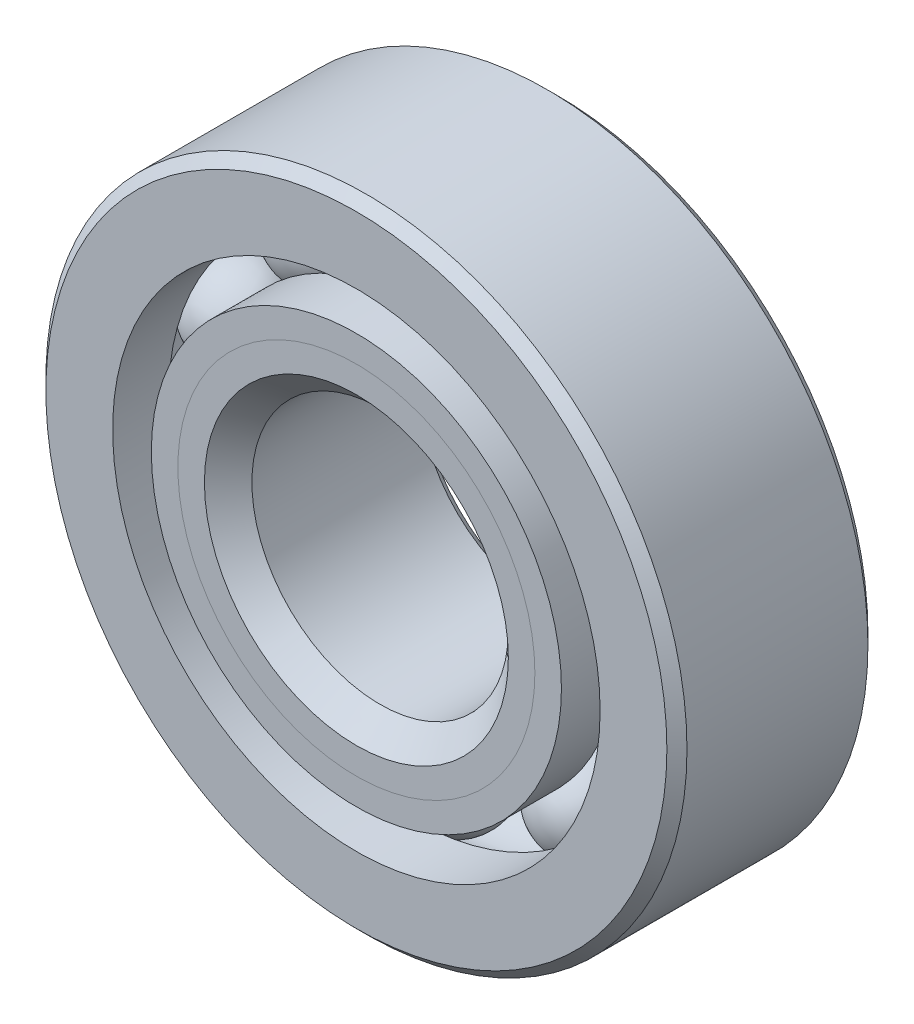
ISO-10303-21;
HEADER;
FILE_DESCRIPTION(('STEP AP214'),'2;1');
FILE_NAME('part.step','',(''),(''),'','','');
FILE_SCHEMA(('AUTOMOTIVE_DESIGN { 1 0 10303 214 1 1 1 1 }'));
ENDSEC;
DATA;
#1=APPLICATION_CONTEXT('core data for automotive mechanical design processes');
#2=APPLICATION_PROTOCOL_DEFINITION('international standard','automotive_design',2000,#1);
#3=PRODUCT_CONTEXT('',#1,'mechanical');
#4=PRODUCT('Part','Part','',(#3));
#5=PRODUCT_RELATED_PRODUCT_CATEGORY('part','',(#4));
#6=PRODUCT_DEFINITION_FORMATION('','',#4);
#7=PRODUCT_DEFINITION_CONTEXT('part definition',#1,'design');
#8=PRODUCT_DEFINITION('design','',#6,#7);
#9=PRODUCT_DEFINITION_SHAPE('','',#8);
#10=(LENGTH_UNIT() NAMED_UNIT(*) SI_UNIT(.MILLI.,.METRE.));
#11=(NAMED_UNIT(*) PLANE_ANGLE_UNIT() SI_UNIT($,.RADIAN.));
#12=(NAMED_UNIT(*) SI_UNIT($,.STERADIAN.) SOLID_ANGLE_UNIT());
#13=UNCERTAINTY_MEASURE_WITH_UNIT(LENGTH_MEASURE(1.E-05),#10,'distance_accuracy_value','');
#14=(GEOMETRIC_REPRESENTATION_CONTEXT(3) GLOBAL_UNCERTAINTY_ASSIGNED_CONTEXT((#13)) GLOBAL_UNIT_ASSIGNED_CONTEXT((#10,
#11,#12)) REPRESENTATION_CONTEXT('',''));
#15=CARTESIAN_POINT('',(0.,0.,0.));
#16=DIRECTION('',(0.,0.,1.));
#17=DIRECTION('',(1.,0.,0.));
#18=AXIS2_PLACEMENT_3D('',#15,#16,#17);
#19=CARTESIAN_POINT('',(-3.26588180805,4.49510067499584,0.));
#20=DIRECTION('',(0.,0.,1.));
#21=DIRECTION('',(-0.587785252292462,0.809016994374955,0.));
#22=AXIS2_PLACEMENT_3D('',#19,#20,#21);
#23=SPHERICAL_SURFACE('',#22,1.20554465033679);
#24=CARTESIAN_POINT('',(-3.26588180805,4.49510067499584,1.20554465033679));
#25=VERTEX_POINT('',#24);
#26=VERTEX_LOOP('',#25);
#27=FACE_BOUND('',#26,.T.);
#28=ADVANCED_FACE('F42',(#27),#23,.T.);
#29=CLOSED_SHELL('',(#28));
#30=MANIFOLD_SOLID_BREP('B2',#29);
#31=CARTESIAN_POINT('',(-5.28430776866493,1.71697567499586,0.));
#32=DIRECTION('',(0.,0.,1.));
#33=DIRECTION('',(-0.95105651629515,0.309016994374958,0.));
#34=AXIS2_PLACEMENT_3D('',#31,#32,#33);
#35=SPHERICAL_SURFACE('',#34,1.20554465033679);
#36=CARTESIAN_POINT('',(-5.28430776866493,1.71697567499586,1.20554465033679));
#37=VERTEX_POINT('',#36);
#38=VERTEX_LOOP('',#37);
#39=FACE_BOUND('',#38,.T.);
#40=ADVANCED_FACE('F76',(#39),#35,.T.);
#41=CLOSED_SHELL('',(#40));
#42=MANIFOLD_SOLID_BREP('B6',#41);
#43=CARTESIAN_POINT('',(-5.28430776866496,-1.71697567499575,0.));
#44=DIRECTION('',(0.,0.,1.));
#45=DIRECTION('',(-0.951056516295157,-0.309016994374938,0.));
#46=AXIS2_PLACEMENT_3D('',#43,#44,#45);
#47=SPHERICAL_SURFACE('',#46,1.20554465033679);
#48=CARTESIAN_POINT('',(-5.28430776866496,-1.71697567499575,1.20554465033679));
#49=VERTEX_POINT('',#48);
#50=VERTEX_LOOP('',#49);
#51=FACE_BOUND('',#50,.T.);
#52=ADVANCED_FACE('F110',(#51),#47,.T.);
#53=CLOSED_SHELL('',(#52));
#54=MANIFOLD_SOLID_BREP('B38',#53);
#55=CARTESIAN_POINT('',(-3.26588180805009,-4.49510067499577,0.));
#56=DIRECTION('',(0.,0.,1.));
#57=DIRECTION('',(-0.58778525229248,-0.809016994374942,0.));
#58=AXIS2_PLACEMENT_3D('',#55,#56,#57);
#59=SPHERICAL_SURFACE('',#58,1.20554465033679);
#60=CARTESIAN_POINT('',(-3.26588180805009,-4.49510067499577,1.20554465033679));
#61=VERTEX_POINT('',#60);
#62=VERTEX_LOOP('',#61);
#63=FACE_BOUND('',#62,.T.);
#64=ADVANCED_FACE('F144',(#63),#59,.T.);
#65=CLOSED_SHELL('',(#64));
#66=MANIFOLD_SOLID_BREP('B72',#65);
#67=CARTESIAN_POINT('',(0.,-5.55625,0.));
#68=DIRECTION('',(0.,0.,1.));
#69=DIRECTION('',(0.,-1.,0.));
#70=AXIS2_PLACEMENT_3D('',#67,#68,#69);
#71=SPHERICAL_SURFACE('',#70,1.20554465033679);
#72=CARTESIAN_POINT('',(0.,-5.55625,1.20554465033679));
#73=VERTEX_POINT('',#72);
#74=VERTEX_LOOP('',#73);
#75=FACE_BOUND('',#74,.T.);
#76=ADVANCED_FACE('F178',(#75),#71,.T.);
#77=CLOSED_SHELL('',(#76));
#78=MANIFOLD_SOLID_BREP('B106',#77);
#79=CARTESIAN_POINT('',(3.26588180805003,-4.49510067499582,0.));
#80=DIRECTION('',(0.,0.,1.));
#81=DIRECTION('',(0.587785252292469,-0.809016994374951,0.));
#82=AXIS2_PLACEMENT_3D('',#79,#80,#81);
#83=SPHERICAL_SURFACE('',#82,1.20554465033679);
#84=CARTESIAN_POINT('',(3.26588180805003,-4.49510067499582,1.20554465033679));
#85=VERTEX_POINT('',#84);
#86=VERTEX_LOOP('',#85);
#87=FACE_BOUND('',#86,.T.);
#88=ADVANCED_FACE('F212',(#87),#83,.T.);
#89=CLOSED_SHELL('',(#88));
#90=MANIFOLD_SOLID_BREP('B140',#89);
#91=CARTESIAN_POINT('',(5.28430776866494,-1.71697567499582,0.));
#92=DIRECTION('',(0.,0.,1.));
#93=DIRECTION('',(0.951056516295152,-0.309016994374952,0.));
#94=AXIS2_PLACEMENT_3D('',#91,#92,#93);
#95=SPHERICAL_SURFACE('',#94,1.20554465033679);
#96=CARTESIAN_POINT('',(5.28430776866494,-1.71697567499582,1.20554465033679));
#97=VERTEX_POINT('',#96);
#98=VERTEX_LOOP('',#97);
#99=FACE_BOUND('',#98,.T.);
#100=ADVANCED_FACE('F246',(#99),#95,.T.);
#101=CLOSED_SHELL('',(#100));
#102=MANIFOLD_SOLID_BREP('B174',#101);
#103=CARTESIAN_POINT('',(5.28430776866495,1.71697567499579,0.));
#104=DIRECTION('',(0.,0.,1.));
#105=DIRECTION('',(0.951056516295155,0.309016994374945,0.));
#106=AXIS2_PLACEMENT_3D('',#103,#104,#105);
#107=SPHERICAL_SURFACE('',#106,1.20554465033679);
#108=CARTESIAN_POINT('',(5.28430776866495,1.71697567499579,1.20554465033679));
#109=VERTEX_POINT('',#108);
#110=VERTEX_LOOP('',#109);
#111=FACE_BOUND('',#110,.T.);
#112=ADVANCED_FACE('F280',(#111),#107,.T.);
#113=CLOSED_SHELL('',(#112));
#114=MANIFOLD_SOLID_BREP('B208',#113);
#115=CARTESIAN_POINT('',(3.26588180805006,4.4951006749958,0.));
#116=DIRECTION('',(0.,0.,1.));
#117=DIRECTION('',(0.587785252292474,0.809016994374947,0.));
#118=AXIS2_PLACEMENT_3D('',#115,#116,#117);
#119=SPHERICAL_SURFACE('',#118,1.20554465033679);
#120=CARTESIAN_POINT('',(3.26588180805006,4.4951006749958,1.20554465033679));
#121=VERTEX_POINT('',#120);
#122=VERTEX_LOOP('',#121);
#123=FACE_BOUND('',#122,.T.);
#124=ADVANCED_FACE('F314',(#123),#119,.T.);
#125=CLOSED_SHELL('',(#124));
#126=MANIFOLD_SOLID_BREP('B242',#125);
#127=CARTESIAN_POINT('',(0.,5.55625,0.));
#128=DIRECTION('',(0.,0.,1.));
#129=DIRECTION('',(0.,1.,0.));
#130=AXIS2_PLACEMENT_3D('',#127,#128,#129);
#131=SPHERICAL_SURFACE('',#130,1.20554465033679);
#132=CARTESIAN_POINT('',(0.,5.55625,1.20554465033679));
#133=VERTEX_POINT('',#132);
#134=VERTEX_LOOP('',#133);
#135=FACE_BOUND('',#134,.T.);
#136=ADVANCED_FACE('F350',(#135),#131,.T.);
#137=CLOSED_SHELL('',(#136));
#138=MANIFOLD_SOLID_BREP('B276',#137);
#139=CARTESIAN_POINT('',(0.,4.42006562313009,2.4892));
#140=DIRECTION('',(0.,0.,-1.));
#141=DIRECTION('',(-1.,0.,0.));
#142=AXIS2_PLACEMENT_3D('',#139,#140,#141);
#143=PLANE('',#142);
#144=CARTESIAN_POINT('',(0.,0.,2.4892));
#145=DIRECTION('',(0.,0.,1.));
#146=DIRECTION('',(1.,0.,0.));
#147=AXIS2_PLACEMENT_3D('',#144,#145,#146);
#148=CIRCLE('',#147,3.76285267483161);
#149=CARTESIAN_POINT('',(3.76285267483161,0.,2.4892));
#150=VERTEX_POINT('',#149);
#151=EDGE_CURVE('E405',#150,#150,#148,.T.);
#152=ORIENTED_EDGE('',*,*,#151,.F.);
#153=EDGE_LOOP('',(#152));
#154=FACE_BOUND('',#153,.T.);
#155=CARTESIAN_POINT('',(0.,0.,2.4892));
#156=DIRECTION('',(0.,0.,1.));
#157=DIRECTION('',(1.,0.,0.));
#158=AXIS2_PLACEMENT_3D('',#155,#156,#157);
#159=CIRCLE('',#158,4.42006562313009);
#160=CARTESIAN_POINT('',(4.42006562313009,0.,2.4892));
#161=VERTEX_POINT('',#160);
#162=EDGE_CURVE('E349',#161,#161,#159,.T.);
#163=ORIENTED_EDGE('',*,*,#162,.T.);
#164=EDGE_LOOP('',(#163));
#165=FACE_BOUND('',#164,.T.);
#166=ADVANCED_FACE('F371',(#154,#165),#143,.F.);
#167=CARTESIAN_POINT('',(0.,0.,1.83198705170152));
#168=DIRECTION('',(0.,0.,1.));
#169=DIRECTION('',(1.,0.,0.));
#170=AXIS2_PLACEMENT_3D('',#167,#168,#169);
#171=CONICAL_SURFACE('',#170,3.7628526748316,0.78539816339745);
#172=ORIENTED_EDGE('',*,*,#162,.F.);
#173=EDGE_LOOP('',(#172));
#174=FACE_BOUND('',#173,.T.);
#175=CARTESIAN_POINT('',(0.,0.,1.83198705170152));
#176=DIRECTION('',(0.,0.,1.));
#177=DIRECTION('',(1.,0.,0.));
#178=AXIS2_PLACEMENT_3D('',#175,#176,#177);
#179=CIRCLE('',#178,3.7628526748316);
#180=CARTESIAN_POINT('',(3.7628526748316,0.,1.83198705170152));
#181=VERTEX_POINT('',#180);
#182=EDGE_CURVE('E377',#181,#181,#179,.T.);
#183=ORIENTED_EDGE('',*,*,#182,.T.);
#184=EDGE_LOOP('',(#183));
#185=FACE_BOUND('',#184,.T.);
#186=ADVANCED_FACE('F412',(#174,#185),#171,.T.);
#187=CARTESIAN_POINT('',(0.,0.,2.4892));
#188=DIRECTION('',(0.,0.,1.));
#189=DIRECTION('',(1.,0.,0.));
#190=AXIS2_PLACEMENT_3D('',#187,#188,#189);
#191=CYLINDRICAL_SURFACE('',#190,3.7628526748316);
#192=ORIENTED_EDGE('',*,*,#182,.F.);
#193=EDGE_LOOP('',(#192));
#194=FACE_BOUND('',#193,.T.);
#195=CARTESIAN_POINT('',(0.,0.,0.));
#196=DIRECTION('',(0.,0.,1.));
#197=DIRECTION('',(1.,0.,0.));
#198=AXIS2_PLACEMENT_3D('',#195,#196,#197);
#199=CIRCLE('',#198,3.7628526748316);
#200=CARTESIAN_POINT('',(3.7628526748316,0.,0.));
#201=VERTEX_POINT('',#200);
#202=EDGE_CURVE('E381',#201,#201,#199,.T.);
#203=ORIENTED_EDGE('',*,*,#202,.T.);
#204=EDGE_LOOP('',(#203));
#205=FACE_BOUND('',#204,.T.);
#206=ADVANCED_FACE('F416',(#194,#205),#191,.T.);
#207=CARTESIAN_POINT('',(0.,3.7628526748316,0.));
#208=DIRECTION('',(0.,0.,-1.));
#209=DIRECTION('',(-1.,0.,0.));
#210=AXIS2_PLACEMENT_3D('',#207,#208,#209);
#211=PLANE('',#210);
#212=ORIENTED_EDGE('',*,*,#202,.F.);
#213=EDGE_LOOP('',(#212));
#214=FACE_BOUND('',#213,.T.);
#215=CARTESIAN_POINT('',(0.,0.,0.));
#216=DIRECTION('',(0.,0.,1.));
#217=DIRECTION('',(1.,0.,0.));
#218=AXIS2_PLACEMENT_3D('',#215,#216,#217);
#219=CIRCLE('',#218,4.35070534966321);
#220=CARTESIAN_POINT('',(4.35070534966321,0.,0.));
#221=VERTEX_POINT('',#220);
#222=EDGE_CURVE('E385',#221,#221,#219,.T.);
#223=ORIENTED_EDGE('',*,*,#222,.T.);
#224=EDGE_LOOP('',(#223));
#225=FACE_BOUND('',#224,.T.);
#226=ADVANCED_FACE('F421',(#214,#225),#211,.F.);
#227=CARTESIAN_POINT('',(0.,0.,0.));
#228=DIRECTION('',(0.,0.,1.));
#229=DIRECTION('',(1.,0.,0.));
#230=AXIS2_PLACEMENT_3D('',#227,#228,#229);
#231=TOROIDAL_SURFACE('',#230,5.55625,1.20554465033679);
#232=ORIENTED_EDGE('',*,*,#222,.F.);
#233=EDGE_LOOP('',(#232));
#234=FACE_BOUND('',#233,.T.);
#235=CARTESIAN_POINT('',(0.,0.,-1.10631111111111));
#236=DIRECTION('',(0.,0.,1.));
#237=DIRECTION('',(1.,0.,0.));
#238=AXIS2_PLACEMENT_3D('',#235,#236,#237);
#239=CIRCLE('',#238,5.07727857142857);
#240=CARTESIAN_POINT('',(5.07727857142857,0.,-1.10631111111111));
#241=VERTEX_POINT('',#240);
#242=EDGE_CURVE('E390',#241,#241,#239,.T.);
#243=ORIENTED_EDGE('',*,*,#242,.T.);
#244=EDGE_LOOP('',(#243));
#245=FACE_BOUND('',#244,.T.);
#246=ADVANCED_FACE('F427',(#234,#245),#231,.F.);
#247=CARTESIAN_POINT('',(0.,0.,2.4892));
#248=DIRECTION('',(0.,0.,1.));
#249=DIRECTION('',(1.,0.,0.));
#250=AXIS2_PLACEMENT_3D('',#247,#248,#249);
#251=CYLINDRICAL_SURFACE('',#250,5.07727857142857);
#252=ORIENTED_EDGE('',*,*,#242,.F.);
#253=EDGE_LOOP('',(#252));
#254=FACE_BOUND('',#253,.T.);
#255=CARTESIAN_POINT('',(0.,0.,-2.4892));
#256=DIRECTION('',(0.,0.,1.));
#257=DIRECTION('',(1.,0.,0.));
#258=AXIS2_PLACEMENT_3D('',#255,#256,#257);
#259=CIRCLE('',#258,5.07727857142857);
#260=CARTESIAN_POINT('',(5.07727857142857,0.,-2.4892));
#261=VERTEX_POINT('',#260);
#262=EDGE_CURVE('E393',#261,#261,#259,.T.);
#263=ORIENTED_EDGE('',*,*,#262,.T.);
#264=EDGE_LOOP('',(#263));
#265=FACE_BOUND('',#264,.T.);
#266=ADVANCED_FACE('F431',(#254,#265),#251,.T.);
#267=CARTESIAN_POINT('',(0.,3.42392,-2.4892));
#268=DIRECTION('',(0.,0.,1.));
#269=DIRECTION('',(1.,0.,0.));
#270=AXIS2_PLACEMENT_3D('',#267,#268,#269);
#271=PLANE('',#270);
#272=ORIENTED_EDGE('',*,*,#262,.F.);
#273=EDGE_LOOP('',(#272));
#274=FACE_BOUND('',#273,.T.);
#275=CARTESIAN_POINT('',(0.,0.,-2.4892));
#276=DIRECTION('',(0.,0.,1.));
#277=DIRECTION('',(1.,0.,0.));
#278=AXIS2_PLACEMENT_3D('',#275,#276,#277);
#279=CIRCLE('',#278,3.42392);
#280=CARTESIAN_POINT('',(3.42392,0.,-2.4892));
#281=VERTEX_POINT('',#280);
#282=EDGE_CURVE('E396',#281,#281,#279,.T.);
#283=ORIENTED_EDGE('',*,*,#282,.T.);
#284=EDGE_LOOP('',(#283));
#285=FACE_BOUND('',#284,.T.);
#286=ADVANCED_FACE('F435',(#274,#285),#271,.F.);
#287=CARTESIAN_POINT('',(0.,0.,-2.24028));
#288=DIRECTION('',(0.,0.,-1.));
#289=DIRECTION('',(-1.,0.,0.));
#290=AXIS2_PLACEMENT_3D('',#287,#288,#289);
#291=CONICAL_SURFACE('',#290,3.175,0.785398163397447);
#292=ORIENTED_EDGE('',*,*,#282,.F.);
#293=EDGE_LOOP('',(#292));
#294=FACE_BOUND('',#293,.T.);
#295=CARTESIAN_POINT('',(0.,0.,-2.24028));
#296=DIRECTION('',(0.,0.,1.));
#297=DIRECTION('',(1.,0.,0.));
#298=AXIS2_PLACEMENT_3D('',#295,#296,#297);
#299=CIRCLE('',#298,3.175);
#300=CARTESIAN_POINT('',(3.175,0.,-2.24028));
#301=VERTEX_POINT('',#300);
#302=EDGE_CURVE('E399',#301,#301,#299,.T.);
#303=ORIENTED_EDGE('',*,*,#302,.T.);
#304=EDGE_LOOP('',(#303));
#305=FACE_BOUND('',#304,.T.);
#306=ADVANCED_FACE('F439',(#294,#305),#291,.F.);
#307=CARTESIAN_POINT('',(0.,0.,2.4892));
#308=DIRECTION('',(0.,0.,1.));
#309=DIRECTION('',(1.,0.,0.));
#310=AXIS2_PLACEMENT_3D('',#307,#308,#309);
#311=CYLINDRICAL_SURFACE('',#310,3.175);
#312=ORIENTED_EDGE('',*,*,#302,.F.);
#313=EDGE_LOOP('',(#312));
#314=FACE_BOUND('',#313,.T.);
#315=CARTESIAN_POINT('',(0.,0.,1.9013473251684));
#316=DIRECTION('',(0.,0.,1.));
#317=DIRECTION('',(1.,0.,0.));
#318=AXIS2_PLACEMENT_3D('',#315,#316,#317);
#319=CIRCLE('',#318,3.175);
#320=CARTESIAN_POINT('',(3.175,0.,1.9013473251684));
#321=VERTEX_POINT('',#320);
#322=EDGE_CURVE('E402',#321,#321,#319,.T.);
#323=ORIENTED_EDGE('',*,*,#322,.T.);
#324=EDGE_LOOP('',(#323));
#325=FACE_BOUND('',#324,.T.);
#326=ADVANCED_FACE('F443',(#314,#325),#311,.F.);
#327=CARTESIAN_POINT('',(0.,0.,2.4892));
#328=DIRECTION('',(0.,0.,1.));
#329=DIRECTION('',(1.,0.,0.));
#330=AXIS2_PLACEMENT_3D('',#327,#328,#329);
#331=CONICAL_SURFACE('',#330,3.76285267483161,0.785398163397451);
#332=ORIENTED_EDGE('',*,*,#322,.F.);
#333=EDGE_LOOP('',(#332));
#334=FACE_BOUND('',#333,.T.);
#335=ORIENTED_EDGE('',*,*,#151,.T.);
#336=EDGE_LOOP('',(#335));
#337=FACE_BOUND('',#336,.T.);
#338=ADVANCED_FACE('F409',(#334,#337),#331,.F.);
#339=CLOSED_SHELL('',(#166,#186,#206,#226,#246,#266,#286,#306,#326,#338));
#340=MANIFOLD_SOLID_BREP('B310',#339);
#341=CARTESIAN_POINT('',(0.,5.07727857142857,2.4892));
#342=DIRECTION('',(0.,0.,-1.));
#343=DIRECTION('',(-1.,0.,0.));
#344=AXIS2_PLACEMENT_3D('',#341,#342,#343);
#345=PLANE('',#344);
#346=CARTESIAN_POINT('',(0.,0.,2.4892));
#347=DIRECTION('',(0.,0.,1.));
#348=DIRECTION('',(1.,0.,0.));
#349=AXIS2_PLACEMENT_3D('',#346,#347,#348);
#350=CIRCLE('',#349,4.42006562313009);
#351=CARTESIAN_POINT('',(4.42006562313009,0.,2.4892));
#352=VERTEX_POINT('',#351);
#353=EDGE_CURVE('E370',#352,#352,#350,.T.);
#354=ORIENTED_EDGE('',*,*,#353,.F.);
#355=EDGE_LOOP('',(#354));
#356=FACE_BOUND('',#355,.T.);
#357=CARTESIAN_POINT('',(0.,0.,2.4892));
#358=DIRECTION('',(0.,0.,1.));
#359=DIRECTION('',(1.,0.,0.));
#360=AXIS2_PLACEMENT_3D('',#357,#358,#359);
#361=CIRCLE('',#360,5.07727857142857);
#362=CARTESIAN_POINT('',(5.07727857142857,0.,2.4892));
#363=VERTEX_POINT('',#362);
#364=EDGE_CURVE('E552',#363,#363,#361,.T.);
#365=ORIENTED_EDGE('',*,*,#364,.T.);
#366=EDGE_LOOP('',(#365));
#367=FACE_BOUND('',#366,.T.);
#368=ADVANCED_FACE('F530',(#356,#367),#345,.F.);
#369=CARTESIAN_POINT('',(0.,0.,2.4892));
#370=DIRECTION('',(0.,0.,1.));
#371=DIRECTION('',(1.,0.,0.));
#372=AXIS2_PLACEMENT_3D('',#369,#370,#371);
#373=CONICAL_SURFACE('',#372,4.42006562313009,0.78539816339745);
#374=CARTESIAN_POINT('',(0.,0.,1.83198705170152));
#375=DIRECTION('',(0.,0.,1.));
#376=DIRECTION('',(1.,0.,0.));
#377=AXIS2_PLACEMENT_3D('',#374,#375,#376);
#378=CIRCLE('',#377,3.7628526748316);
#379=CARTESIAN_POINT('',(3.7628526748316,0.,1.83198705170152));
#380=VERTEX_POINT('',#379);
#381=EDGE_CURVE('E536',#380,#380,#378,.T.);
#382=ORIENTED_EDGE('',*,*,#381,.F.);
#383=EDGE_LOOP('',(#382));
#384=FACE_BOUND('',#383,.T.);
#385=ORIENTED_EDGE('',*,*,#353,.T.);
#386=EDGE_LOOP('',(#385));
#387=FACE_BOUND('',#386,.T.);
#388=ADVANCED_FACE('F577',(#384,#387),#373,.F.);
#389=CARTESIAN_POINT('',(0.,0.,2.4892));
#390=DIRECTION('',(0.,0.,1.));
#391=DIRECTION('',(1.,0.,0.));
#392=AXIS2_PLACEMENT_3D('',#389,#390,#391);
#393=CYLINDRICAL_SURFACE('',#392,3.7628526748316);
#394=CARTESIAN_POINT('',(0.,0.,0.));
#395=DIRECTION('',(0.,0.,1.));
#396=DIRECTION('',(1.,0.,0.));
#397=AXIS2_PLACEMENT_3D('',#394,#395,#396);
#398=CIRCLE('',#397,3.7628526748316);
#399=CARTESIAN_POINT('',(3.7628526748316,0.,0.));
#400=VERTEX_POINT('',#399);
#401=EDGE_CURVE('E540',#400,#400,#398,.T.);
#402=ORIENTED_EDGE('',*,*,#401,.F.);
#403=EDGE_LOOP('',(#402));
#404=FACE_BOUND('',#403,.T.);
#405=ORIENTED_EDGE('',*,*,#381,.T.);
#406=EDGE_LOOP('',(#405));
#407=FACE_BOUND('',#406,.T.);
#408=ADVANCED_FACE('F572',(#404,#407),#393,.F.);
#409=CARTESIAN_POINT('',(0.,3.7628526748316,0.));
#410=DIRECTION('',(0.,0.,1.));
#411=DIRECTION('',(1.,0.,0.));
#412=AXIS2_PLACEMENT_3D('',#409,#410,#411);
#413=PLANE('',#412);
#414=CARTESIAN_POINT('',(0.,0.,0.));
#415=DIRECTION('',(0.,0.,1.));
#416=DIRECTION('',(1.,0.,0.));
#417=AXIS2_PLACEMENT_3D('',#414,#415,#416);
#418=CIRCLE('',#417,4.35070534966321);
#419=CARTESIAN_POINT('',(4.35070534966321,0.,0.));
#420=VERTEX_POINT('',#419);
#421=EDGE_CURVE('E544',#420,#420,#418,.T.);
#422=ORIENTED_EDGE('',*,*,#421,.F.);
#423=EDGE_LOOP('',(#422));
#424=FACE_BOUND('',#423,.T.);
#425=ORIENTED_EDGE('',*,*,#401,.T.);
#426=EDGE_LOOP('',(#425));
#427=FACE_BOUND('',#426,.T.);
#428=ADVANCED_FACE('F566',(#424,#427),#413,.F.);
#429=CARTESIAN_POINT('',(0.,0.,0.));
#430=DIRECTION('',(0.,0.,1.));
#431=DIRECTION('',(1.,0.,0.));
#432=AXIS2_PLACEMENT_3D('',#429,#430,#431);
#433=TOROIDAL_SURFACE('',#432,5.55625,1.20554465033679);
#434=CARTESIAN_POINT('',(0.,0.,1.10631111111111));
#435=DIRECTION('',(0.,0.,1.));
#436=DIRECTION('',(1.,0.,0.));
#437=AXIS2_PLACEMENT_3D('',#434,#435,#436);
#438=CIRCLE('',#437,5.07727857142857);
#439=CARTESIAN_POINT('',(5.07727857142857,0.,1.10631111111111));
#440=VERTEX_POINT('',#439);
#441=EDGE_CURVE('E549',#440,#440,#438,.T.);
#442=ORIENTED_EDGE('',*,*,#441,.F.);
#443=EDGE_LOOP('',(#442));
#444=FACE_BOUND('',#443,.T.);
#445=ORIENTED_EDGE('',*,*,#421,.T.);
#446=EDGE_LOOP('',(#445));
#447=FACE_BOUND('',#446,.T.);
#448=ADVANCED_FACE('F560',(#444,#447),#433,.F.);
#449=CARTESIAN_POINT('',(0.,0.,2.4892));
#450=DIRECTION('',(0.,0.,1.));
#451=DIRECTION('',(1.,0.,0.));
#452=AXIS2_PLACEMENT_3D('',#449,#450,#451);
#453=CYLINDRICAL_SURFACE('',#452,5.07727857142857);
#454=ORIENTED_EDGE('',*,*,#364,.F.);
#455=EDGE_LOOP('',(#454));
#456=FACE_BOUND('',#455,.T.);
#457=ORIENTED_EDGE('',*,*,#441,.T.);
#458=EDGE_LOOP('',(#457));
#459=FACE_BOUND('',#458,.T.);
#460=ADVANCED_FACE('F557',(#456,#459),#453,.T.);
#461=CLOSED_SHELL('',(#368,#388,#408,#428,#448,#460));
#462=MANIFOLD_SOLID_BREP('B344',#461);
#463=CARTESIAN_POINT('',(0.,0.,2.24028));
#464=DIRECTION('',(0.,0.,-1.));
#465=DIRECTION('',(-1.,0.,0.));
#466=AXIS2_PLACEMENT_3D('',#463,#464,#465);
#467=CONICAL_SURFACE('',#466,7.9375,0.785398163397449);
#468=CARTESIAN_POINT('',(0.,0.,2.4892));
#469=DIRECTION('',(0.,0.,1.));
#470=DIRECTION('',(1.,0.,0.));
#471=AXIS2_PLACEMENT_3D('',#468,#469,#470);
#472=CIRCLE('',#471,7.68858);
#473=CARTESIAN_POINT('',(7.68858,0.,2.4892));
#474=VERTEX_POINT('',#473);
#475=EDGE_CURVE('E650',#474,#474,#472,.T.);
#476=ORIENTED_EDGE('',*,*,#475,.F.);
#477=EDGE_LOOP('',(#476));
#478=FACE_BOUND('',#477,.T.);
#479=CARTESIAN_POINT('',(0.,0.,2.24028));
#480=DIRECTION('',(0.,0.,1.));
#481=DIRECTION('',(1.,0.,0.));
#482=AXIS2_PLACEMENT_3D('',#479,#480,#481);
#483=CIRCLE('',#482,7.9375);
#484=CARTESIAN_POINT('',(7.9375,0.,2.24028));
#485=VERTEX_POINT('',#484);
#486=EDGE_CURVE('E529',#485,#485,#483,.T.);
#487=ORIENTED_EDGE('',*,*,#486,.T.);
#488=EDGE_LOOP('',(#487));
#489=FACE_BOUND('',#488,.T.);
#490=ADVANCED_FACE('F622',(#478,#489),#467,.T.);
#491=CARTESIAN_POINT('',(0.,0.,2.4892));
#492=DIRECTION('',(0.,0.,1.));
#493=DIRECTION('',(1.,0.,0.));
#494=AXIS2_PLACEMENT_3D('',#491,#492,#493);
#495=CYLINDRICAL_SURFACE('',#494,7.9375);
#496=ORIENTED_EDGE('',*,*,#486,.F.);
#497=EDGE_LOOP('',(#496));
#498=FACE_BOUND('',#497,.T.);
#499=CARTESIAN_POINT('',(0.,0.,-2.24028));
#500=DIRECTION('',(0.,0.,1.));
#501=DIRECTION('',(1.,0.,0.));
#502=AXIS2_PLACEMENT_3D('',#499,#500,#501);
#503=CIRCLE('',#502,7.9375);
#504=CARTESIAN_POINT('',(7.9375,0.,-2.24028));
#505=VERTEX_POINT('',#504);
#506=EDGE_CURVE('E628',#505,#505,#503,.T.);
#507=ORIENTED_EDGE('',*,*,#506,.T.);
#508=EDGE_LOOP('',(#507));
#509=FACE_BOUND('',#508,.T.);
#510=ADVANCED_FACE('F657',(#498,#509),#495,.T.);
#511=CARTESIAN_POINT('',(0.,0.,-2.4892));
#512=DIRECTION('',(0.,0.,1.));
#513=DIRECTION('',(1.,0.,0.));
#514=AXIS2_PLACEMENT_3D('',#511,#512,#513);
#515=CONICAL_SURFACE('',#514,7.68858,0.785398163397447);
#516=ORIENTED_EDGE('',*,*,#506,.F.);
#517=EDGE_LOOP('',(#516));
#518=FACE_BOUND('',#517,.T.);
#519=CARTESIAN_POINT('',(0.,0.,-2.4892));
#520=DIRECTION('',(0.,0.,1.));
#521=DIRECTION('',(1.,0.,0.));
#522=AXIS2_PLACEMENT_3D('',#519,#520,#521);
#523=CIRCLE('',#522,7.68858);
#524=CARTESIAN_POINT('',(7.68858,0.,-2.4892));
#525=VERTEX_POINT('',#524);
#526=EDGE_CURVE('E632',#525,#525,#523,.T.);
#527=ORIENTED_EDGE('',*,*,#526,.T.);
#528=EDGE_LOOP('',(#527));
#529=FACE_BOUND('',#528,.T.);
#530=ADVANCED_FACE('F661',(#518,#529),#515,.T.);
#531=CARTESIAN_POINT('',(0.,7.68858,-2.4892));
#532=DIRECTION('',(0.,0.,1.));
#533=DIRECTION('',(1.,0.,0.));
#534=AXIS2_PLACEMENT_3D('',#531,#532,#533);
#535=PLANE('',#534);
#536=ORIENTED_EDGE('',*,*,#526,.F.);
#537=EDGE_LOOP('',(#536));
#538=FACE_BOUND('',#537,.T.);
#539=CARTESIAN_POINT('',(0.,0.,-2.4892));
#540=DIRECTION('',(0.,0.,1.));
#541=DIRECTION('',(1.,0.,0.));
#542=AXIS2_PLACEMENT_3D('',#539,#540,#541);
#543=CIRCLE('',#542,6.03522142857143);
#544=CARTESIAN_POINT('',(6.03522142857143,0.,-2.4892));
#545=VERTEX_POINT('',#544);
#546=EDGE_CURVE('E636',#545,#545,#543,.T.);
#547=ORIENTED_EDGE('',*,*,#546,.T.);
#548=EDGE_LOOP('',(#547));
#549=FACE_BOUND('',#548,.T.);
#550=ADVANCED_FACE('F666',(#538,#549),#535,.F.);
#551=CARTESIAN_POINT('',(0.,0.,2.4892));
#552=DIRECTION('',(0.,0.,1.));
#553=DIRECTION('',(1.,0.,0.));
#554=AXIS2_PLACEMENT_3D('',#551,#552,#553);
#555=CYLINDRICAL_SURFACE('',#554,6.03522142857143);
#556=ORIENTED_EDGE('',*,*,#546,.F.);
#557=EDGE_LOOP('',(#556));
#558=FACE_BOUND('',#557,.T.);
#559=CARTESIAN_POINT('',(0.,0.,-1.10631111111111));
#560=DIRECTION('',(0.,0.,1.));
#561=DIRECTION('',(1.,0.,0.));
#562=AXIS2_PLACEMENT_3D('',#559,#560,#561);
#563=CIRCLE('',#562,6.03522142857143);
#564=CARTESIAN_POINT('',(6.03522142857143,0.,-1.10631111111111));
#565=VERTEX_POINT('',#564);
#566=EDGE_CURVE('E641',#565,#565,#563,.T.);
#567=ORIENTED_EDGE('',*,*,#566,.T.);
#568=EDGE_LOOP('',(#567));
#569=FACE_BOUND('',#568,.T.);
#570=ADVANCED_FACE('F672',(#558,#569),#555,.F.);
#571=CARTESIAN_POINT('',(0.,0.,0.));
#572=DIRECTION('',(0.,0.,1.));
#573=DIRECTION('',(1.,0.,0.));
#574=AXIS2_PLACEMENT_3D('',#571,#572,#573);
#575=TOROIDAL_SURFACE('',#574,5.55625,1.20554465033679);
#576=ORIENTED_EDGE('',*,*,#566,.F.);
#577=EDGE_LOOP('',(#576));
#578=FACE_BOUND('',#577,.T.);
#579=CARTESIAN_POINT('',(0.,0.,1.10631111111111));
#580=DIRECTION('',(0.,0.,1.));
#581=DIRECTION('',(1.,0.,0.));
#582=AXIS2_PLACEMENT_3D('',#579,#580,#581);
#583=CIRCLE('',#582,6.03522142857143);
#584=CARTESIAN_POINT('',(6.03522142857143,0.,1.10631111111111));
#585=VERTEX_POINT('',#584);
#586=EDGE_CURVE('E644',#585,#585,#583,.T.);
#587=ORIENTED_EDGE('',*,*,#586,.T.);
#588=EDGE_LOOP('',(#587));
#589=FACE_BOUND('',#588,.T.);
#590=ADVANCED_FACE('F676',(#578,#589),#575,.F.);
#591=CARTESIAN_POINT('',(0.,0.,2.4892));
#592=DIRECTION('',(0.,0.,1.));
#593=DIRECTION('',(1.,0.,0.));
#594=AXIS2_PLACEMENT_3D('',#591,#592,#593);
#595=CYLINDRICAL_SURFACE('',#594,6.03522142857143);
#596=ORIENTED_EDGE('',*,*,#586,.F.);
#597=EDGE_LOOP('',(#596));
#598=FACE_BOUND('',#597,.T.);
#599=CARTESIAN_POINT('',(0.,0.,2.4892));
#600=DIRECTION('',(0.,0.,1.));
#601=DIRECTION('',(1.,0.,0.));
#602=AXIS2_PLACEMENT_3D('',#599,#600,#601);
#603=CIRCLE('',#602,6.03522142857143);
#604=CARTESIAN_POINT('',(6.03522142857143,0.,2.4892));
#605=VERTEX_POINT('',#604);
#606=EDGE_CURVE('E647',#605,#605,#603,.T.);
#607=ORIENTED_EDGE('',*,*,#606,.T.);
#608=EDGE_LOOP('',(#607));
#609=FACE_BOUND('',#608,.T.);
#610=ADVANCED_FACE('F680',(#598,#609),#595,.F.);
#611=CARTESIAN_POINT('',(0.,7.68858,2.4892));
#612=DIRECTION('',(0.,0.,-1.));
#613=DIRECTION('',(-1.,0.,0.));
#614=AXIS2_PLACEMENT_3D('',#611,#612,#613);
#615=PLANE('',#614);
#616=ORIENTED_EDGE('',*,*,#606,.F.);
#617=EDGE_LOOP('',(#616));
#618=FACE_BOUND('',#617,.T.);
#619=ORIENTED_EDGE('',*,*,#475,.T.);
#620=EDGE_LOOP('',(#619));
#621=FACE_BOUND('',#620,.T.);
#622=ADVANCED_FACE('F654',(#618,#621),#615,.F.);
#623=CLOSED_SHELL('',(#490,#510,#530,#550,#570,#590,#610,#622));
#624=MANIFOLD_SOLID_BREP('B365',#623);
#625=ADVANCED_BREP_SHAPE_REPRESENTATION('',(#18,#30,#42,#54,#66,#78,#90,#102,#114,#126,#138,
#340,#462,#624),#14);
#626=SHAPE_DEFINITION_REPRESENTATION(#9,#625);
ENDSEC;
END-ISO-10303-21;
